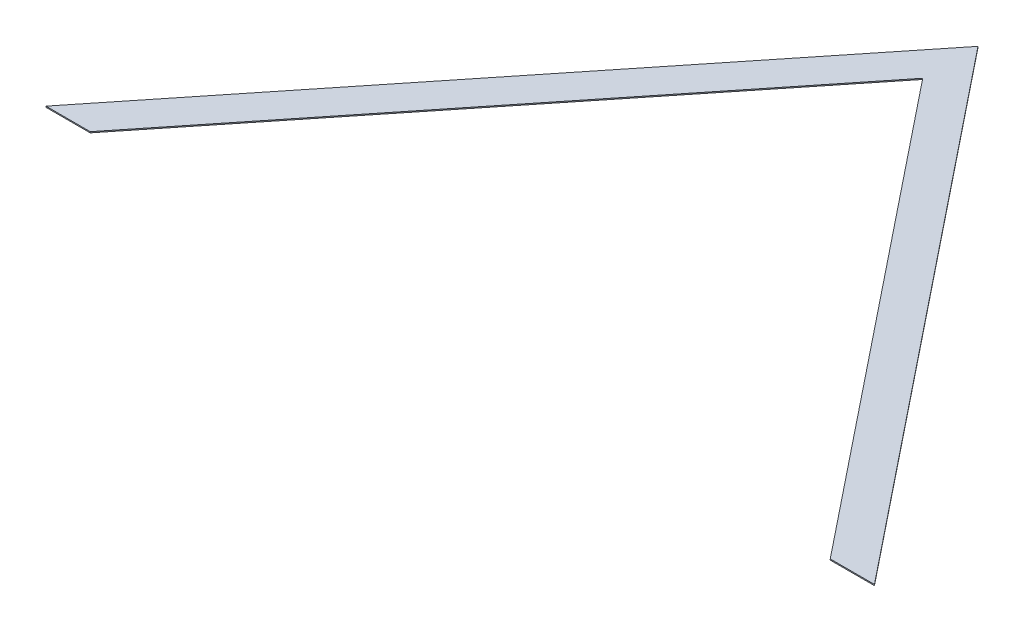
ISO-10303-21;
HEADER;
FILE_DESCRIPTION(('STEP AP214'),'2;1');
FILE_NAME('part.step','',(''),(''),'','','');
FILE_SCHEMA(('AUTOMOTIVE_DESIGN { 1 0 10303 214 1 1 1 1 }'));
ENDSEC;
DATA;
#1=APPLICATION_CONTEXT('core data for automotive mechanical design processes');
#2=APPLICATION_PROTOCOL_DEFINITION('international standard','automotive_design',2000,#1);
#3=PRODUCT_CONTEXT('',#1,'mechanical');
#4=PRODUCT('Part','Part','',(#3));
#5=PRODUCT_RELATED_PRODUCT_CATEGORY('part','',(#4));
#6=PRODUCT_DEFINITION_FORMATION('','',#4);
#7=PRODUCT_DEFINITION_CONTEXT('part definition',#1,'design');
#8=PRODUCT_DEFINITION('design','',#6,#7);
#9=PRODUCT_DEFINITION_SHAPE('','',#8);
#10=(LENGTH_UNIT() NAMED_UNIT(*) SI_UNIT(.MILLI.,.METRE.));
#11=(NAMED_UNIT(*) PLANE_ANGLE_UNIT() SI_UNIT($,.RADIAN.));
#12=(NAMED_UNIT(*) SI_UNIT($,.STERADIAN.) SOLID_ANGLE_UNIT());
#13=UNCERTAINTY_MEASURE_WITH_UNIT(LENGTH_MEASURE(1.E-05),#10,'distance_accuracy_value','');
#14=(GEOMETRIC_REPRESENTATION_CONTEXT(3) GLOBAL_UNCERTAINTY_ASSIGNED_CONTEXT((#13)) GLOBAL_UNIT_ASSIGNED_CONTEXT((#10,
#11,#12)) REPRESENTATION_CONTEXT('',''));
#15=CARTESIAN_POINT('',(0.,0.,0.));
#16=DIRECTION('',(0.,0.,1.));
#17=DIRECTION('',(1.,0.,0.));
#18=AXIS2_PLACEMENT_3D('',#15,#16,#17);
#19=CARTESIAN_POINT('',(544.544257747682,1.5875,0.));
#20=DIRECTION('',(0.,0.,-1.));
#21=DIRECTION('',(-1.,0.,0.));
#22=AXIS2_PLACEMENT_3D('',#19,#20,#21);
#23=PLANE('',#22);
#24=DIRECTION('',(1.,0.,0.));
#25=VECTOR('',#24,1.);
#26=CARTESIAN_POINT('',(544.544257747682,0.,0.));
#27=LINE('',#26,#25);
#28=CARTESIAN_POINT('',(544.544257747682,0.,0.));
#29=VERTEX_POINT('',#28);
#30=CARTESIAN_POINT('',(609.6,0.,1.11022302462516E-13));
#31=VERTEX_POINT('',#30);
#32=EDGE_CURVE('E116',#29,#31,#27,.T.);
#33=ORIENTED_EDGE('',*,*,#32,.T.);
#34=DIRECTION('',(0.,-1.,0.));
#35=VECTOR('',#34,1.);
#36=CARTESIAN_POINT('',(609.6,1.5875,1.11022302462516E-13));
#37=LINE('',#36,#35);
#38=CARTESIAN_POINT('',(609.6,1.5875,1.11022302462516E-13));
#39=VERTEX_POINT('',#38);
#40=EDGE_CURVE('E11',#39,#31,#37,.T.);
#41=ORIENTED_EDGE('',*,*,#40,.F.);
#42=DIRECTION('',(1.,0.,0.));
#43=VECTOR('',#42,1.);
#44=CARTESIAN_POINT('',(544.544257747682,1.5875,0.));
#45=LINE('',#44,#43);
#46=CARTESIAN_POINT('',(544.544257747682,1.5875,0.));
#47=VERTEX_POINT('',#46);
#48=EDGE_CURVE('E126',#47,#39,#45,.T.);
#49=ORIENTED_EDGE('',*,*,#48,.F.);
#50=DIRECTION('',(0.,-1.,0.));
#51=VECTOR('',#50,1.);
#52=CARTESIAN_POINT('',(544.544257747682,1.5875,0.));
#53=LINE('',#52,#51);
#54=EDGE_CURVE('E112',#47,#29,#53,.T.);
#55=ORIENTED_EDGE('',*,*,#54,.T.);
#56=EDGE_LOOP('',(#33,#41,#49,#55));
#57=FACE_BOUND('',#56,.T.);
#58=ADVANCED_FACE('F32',(#57),#23,.F.);
#59=CARTESIAN_POINT('',(609.6,1.5875,1.11022302462516E-13));
#60=DIRECTION('',(-0.78086880944303,0.,0.624695047554424));
#61=DIRECTION('',(0.624695047554424,0.,0.78086880944303));
#62=AXIS2_PLACEMENT_3D('',#59,#60,#61);
#63=PLANE('',#62);
#64=DIRECTION('',(-0.624695047554424,0.,-0.78086880944303));
#65=VECTOR('',#64,1.);
#66=CARTESIAN_POINT('',(609.6,0.,1.11022302462516E-13));
#67=LINE('',#66,#65);
#68=CARTESIAN_POINT('',(0.,0.,-762.));
#69=VERTEX_POINT('',#68);
#70=EDGE_CURVE('E119',#31,#69,#67,.T.);
#71=ORIENTED_EDGE('',*,*,#70,.T.);
#72=DIRECTION('',(0.,-1.,0.));
#73=VECTOR('',#72,1.);
#74=CARTESIAN_POINT('',(0.,1.5875,-762.));
#75=LINE('',#74,#73);
#76=CARTESIAN_POINT('',(0.,1.5875,-762.));
#77=VERTEX_POINT('',#76);
#78=EDGE_CURVE('E40',#77,#69,#75,.T.);
#79=ORIENTED_EDGE('',*,*,#78,.F.);
#80=DIRECTION('',(-0.624695047554424,0.,-0.78086880944303));
#81=VECTOR('',#80,1.);
#82=CARTESIAN_POINT('',(609.6,1.5875,1.11022302462516E-13));
#83=LINE('',#82,#81);
#84=EDGE_CURVE('E85',#39,#77,#83,.T.);
#85=ORIENTED_EDGE('',*,*,#84,.F.);
#86=ORIENTED_EDGE('',*,*,#40,.T.);
#87=EDGE_LOOP('',(#71,#79,#85,#86));
#88=FACE_BOUND('',#87,.T.);
#89=ADVANCED_FACE('F150',(#88),#63,.F.);
#90=CARTESIAN_POINT('',(0.,1.5875,-762.));
#91=DIRECTION('',(0.78086880944303,0.,0.624695047554424));
#92=DIRECTION('',(0.624695047554424,0.,-0.780868809443031));
#93=AXIS2_PLACEMENT_3D('',#90,#91,#92);
#94=PLANE('',#93);
#95=DIRECTION('',(-0.624695047554424,0.,0.78086880944303));
#96=VECTOR('',#95,1.);
#97=CARTESIAN_POINT('',(0.,0.,-762.));
#98=LINE('',#97,#96);
#99=CARTESIAN_POINT('',(-609.6,0.,1.11022302462516E-13));
#100=VERTEX_POINT('',#99);
#101=EDGE_CURVE('E121',#69,#100,#98,.T.);
#102=ORIENTED_EDGE('',*,*,#101,.T.);
#103=DIRECTION('',(0.,-1.,0.));
#104=VECTOR('',#103,1.);
#105=CARTESIAN_POINT('',(-609.6,1.5875,1.11022302462516E-13));
#106=LINE('',#105,#104);
#107=CARTESIAN_POINT('',(-609.6,1.5875,1.11022302462516E-13));
#108=VERTEX_POINT('',#107);
#109=EDGE_CURVE('E107',#108,#100,#106,.T.);
#110=ORIENTED_EDGE('',*,*,#109,.F.);
#111=DIRECTION('',(-0.624695047554424,0.,0.78086880944303));
#112=VECTOR('',#111,1.);
#113=CARTESIAN_POINT('',(0.,1.5875,-762.));
#114=LINE('',#113,#112);
#115=EDGE_CURVE('E98',#77,#108,#114,.T.);
#116=ORIENTED_EDGE('',*,*,#115,.F.);
#117=ORIENTED_EDGE('',*,*,#78,.T.);
#118=EDGE_LOOP('',(#102,#110,#116,#117));
#119=FACE_BOUND('',#118,.T.);
#120=ADVANCED_FACE('F132',(#119),#94,.F.);
#121=CARTESIAN_POINT('',(-609.6,1.5875,1.11022302462516E-13));
#122=DIRECTION('',(0.,0.,-1.));
#123=DIRECTION('',(-1.,0.,0.));
#124=AXIS2_PLACEMENT_3D('',#121,#122,#123);
#125=PLANE('',#124);
#126=DIRECTION('',(1.,0.,0.));
#127=VECTOR('',#126,1.);
#128=CARTESIAN_POINT('',(-609.6,0.,1.11022302462516E-13));
#129=LINE('',#128,#127);
#130=CARTESIAN_POINT('',(-544.544257747682,0.,0.));
#131=VERTEX_POINT('',#130);
#132=EDGE_CURVE('E106',#100,#131,#129,.T.);
#133=ORIENTED_EDGE('',*,*,#132,.T.);
#134=DIRECTION('',(0.,-1.,0.));
#135=VECTOR('',#134,1.);
#136=CARTESIAN_POINT('',(-544.544257747682,1.5875,0.));
#137=LINE('',#136,#135);
#138=CARTESIAN_POINT('',(-544.544257747682,1.5875,0.));
#139=VERTEX_POINT('',#138);
#140=EDGE_CURVE('E103',#139,#131,#137,.T.);
#141=ORIENTED_EDGE('',*,*,#140,.F.);
#142=DIRECTION('',(1.,0.,0.));
#143=VECTOR('',#142,1.);
#144=CARTESIAN_POINT('',(-609.6,1.5875,1.11022302462516E-13));
#145=LINE('',#144,#143);
#146=EDGE_CURVE('E92',#108,#139,#145,.T.);
#147=ORIENTED_EDGE('',*,*,#146,.F.);
#148=ORIENTED_EDGE('',*,*,#109,.T.);
#149=EDGE_LOOP('',(#133,#141,#147,#148));
#150=FACE_BOUND('',#149,.T.);
#151=ADVANCED_FACE('F104',(#150),#125,.F.);
#152=CARTESIAN_POINT('',(-544.544257747682,1.5875,0.));
#153=DIRECTION('',(-0.78086880944303,0.,-0.624695047554425));
#154=DIRECTION('',(-0.624695047554425,0.,0.78086880944303));
#155=AXIS2_PLACEMENT_3D('',#152,#153,#154);
#156=PLANE('',#155);
#157=DIRECTION('',(0.624695047554425,0.,-0.78086880944303));
#158=VECTOR('',#157,1.);
#159=CARTESIAN_POINT('',(-544.544257747682,0.,0.));
#160=LINE('',#159,#158);
#161=CARTESIAN_POINT('',(0.,0.,-680.680322184602));
#162=VERTEX_POINT('',#161);
#163=EDGE_CURVE('E71',#131,#162,#160,.T.);
#164=ORIENTED_EDGE('',*,*,#163,.T.);
#165=DIRECTION('',(0.,-1.,0.));
#166=VECTOR('',#165,1.);
#167=CARTESIAN_POINT('',(0.,1.5875,-680.680322184602));
#168=LINE('',#167,#166);
#169=CARTESIAN_POINT('',(0.,1.5875,-680.680322184602));
#170=VERTEX_POINT('',#169);
#171=EDGE_CURVE('E108',#170,#162,#168,.T.);
#172=ORIENTED_EDGE('',*,*,#171,.F.);
#173=DIRECTION('',(0.624695047554425,0.,-0.78086880944303));
#174=VECTOR('',#173,1.);
#175=CARTESIAN_POINT('',(-544.544257747682,1.5875,0.));
#176=LINE('',#175,#174);
#177=EDGE_CURVE('E96',#139,#170,#176,.T.);
#178=ORIENTED_EDGE('',*,*,#177,.F.);
#179=ORIENTED_EDGE('',*,*,#140,.T.);
#180=EDGE_LOOP('',(#164,#172,#178,#179));
#181=FACE_BOUND('',#180,.T.);
#182=ADVANCED_FACE('F110',(#181),#156,.F.);
#183=CARTESIAN_POINT('',(0.,1.5875,-680.680322184602));
#184=DIRECTION('',(0.78086880944303,0.,-0.624695047554425));
#185=DIRECTION('',(-0.624695047554425,0.,-0.78086880944303));
#186=AXIS2_PLACEMENT_3D('',#183,#184,#185);
#187=PLANE('',#186);
#188=DIRECTION('',(0.624695047554425,0.,0.78086880944303));
#189=VECTOR('',#188,1.);
#190=CARTESIAN_POINT('',(0.,0.,-680.680322184602));
#191=LINE('',#190,#189);
#192=EDGE_CURVE('E77',#162,#29,#191,.T.);
#193=ORIENTED_EDGE('',*,*,#192,.T.);
#194=ORIENTED_EDGE('',*,*,#54,.F.);
#195=DIRECTION('',(0.624695047554425,0.,0.78086880944303));
#196=VECTOR('',#195,1.);
#197=CARTESIAN_POINT('',(0.,1.5875,-680.680322184602));
#198=LINE('',#197,#196);
#199=EDGE_CURVE('E48',#170,#47,#198,.T.);
#200=ORIENTED_EDGE('',*,*,#199,.F.);
#201=ORIENTED_EDGE('',*,*,#171,.T.);
#202=EDGE_LOOP('',(#193,#194,#200,#201));
#203=FACE_BOUND('',#202,.T.);
#204=ADVANCED_FACE('F139',(#203),#187,.F.);
#205=CARTESIAN_POINT('',(0.,1.5875,0.));
#206=DIRECTION('',(0.,1.,0.));
#207=DIRECTION('',(0.,0.,1.));
#208=AXIS2_PLACEMENT_3D('',#205,#206,#207);
#209=PLANE('',#208);
#210=ORIENTED_EDGE('',*,*,#48,.T.);
#211=ORIENTED_EDGE('',*,*,#84,.T.);
#212=ORIENTED_EDGE('',*,*,#115,.T.);
#213=ORIENTED_EDGE('',*,*,#146,.T.);
#214=ORIENTED_EDGE('',*,*,#177,.T.);
#215=ORIENTED_EDGE('',*,*,#199,.T.);
#216=EDGE_LOOP('',(#210,#211,#212,#213,#214,#215));
#217=FACE_BOUND('',#216,.T.);
#218=ADVANCED_FACE('F94',(#217),#209,.T.);
#219=CARTESIAN_POINT('',(0.,0.,0.));
#220=DIRECTION('',(0.,1.,0.));
#221=DIRECTION('',(0.,0.,1.));
#222=AXIS2_PLACEMENT_3D('',#219,#220,#221);
#223=PLANE('',#222);
#224=ORIENTED_EDGE('',*,*,#32,.F.);
#225=ORIENTED_EDGE('',*,*,#192,.F.);
#226=ORIENTED_EDGE('',*,*,#163,.F.);
#227=ORIENTED_EDGE('',*,*,#132,.F.);
#228=ORIENTED_EDGE('',*,*,#101,.F.);
#229=ORIENTED_EDGE('',*,*,#70,.F.);
#230=EDGE_LOOP('',(#224,#225,#226,#227,#228,#229));
#231=FACE_BOUND('',#230,.T.);
#232=ADVANCED_FACE('F135',(#231),#223,.F.);
#233=CLOSED_SHELL('',(#58,#89,#120,#151,#182,#204,#218,#232));
#234=MANIFOLD_SOLID_BREP('B2',#233);
#235=ADVANCED_BREP_SHAPE_REPRESENTATION('',(#18,#234),#14);
#236=SHAPE_DEFINITION_REPRESENTATION(#9,#235);
ENDSEC;
END-ISO-10303-21;
